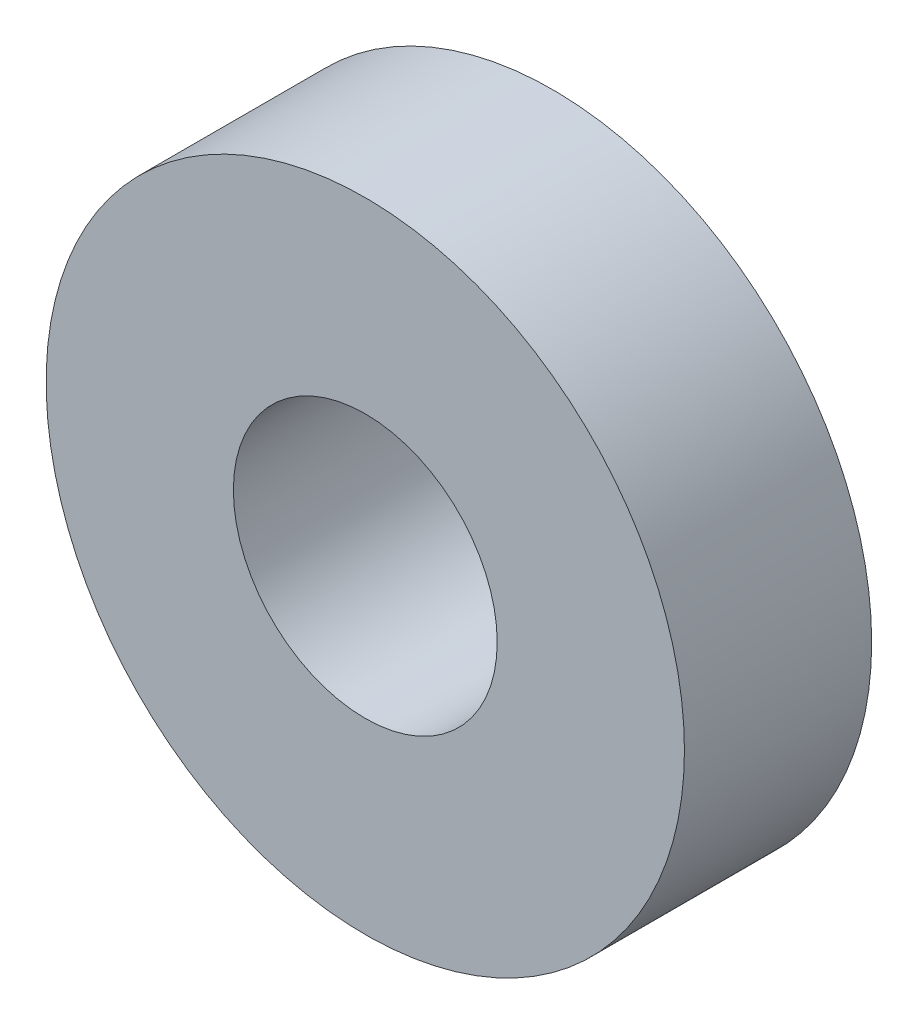
ISO-10303-21;
HEADER;
FILE_DESCRIPTION(('STEP AP214'),'2;1');
FILE_NAME('part.step','',(''),(''),'','','');
FILE_SCHEMA(('AUTOMOTIVE_DESIGN { 1 0 10303 214 1 1 1 1 }'));
ENDSEC;
DATA;
#1=APPLICATION_CONTEXT('core data for automotive mechanical design processes');
#2=APPLICATION_PROTOCOL_DEFINITION('international standard','automotive_design',2000,#1);
#3=PRODUCT_CONTEXT('',#1,'mechanical');
#4=PRODUCT('Part','Part','',(#3));
#5=PRODUCT_RELATED_PRODUCT_CATEGORY('part','',(#4));
#6=PRODUCT_DEFINITION_FORMATION('','',#4);
#7=PRODUCT_DEFINITION_CONTEXT('part definition',#1,'design');
#8=PRODUCT_DEFINITION('design','',#6,#7);
#9=PRODUCT_DEFINITION_SHAPE('','',#8);
#10=(LENGTH_UNIT() NAMED_UNIT(*) SI_UNIT(.MILLI.,.METRE.));
#11=(NAMED_UNIT(*) PLANE_ANGLE_UNIT() SI_UNIT($,.RADIAN.));
#12=(NAMED_UNIT(*) SI_UNIT($,.STERADIAN.) SOLID_ANGLE_UNIT());
#13=UNCERTAINTY_MEASURE_WITH_UNIT(LENGTH_MEASURE(1.E-05),#10,'distance_accuracy_value','');
#14=(GEOMETRIC_REPRESENTATION_CONTEXT(3) GLOBAL_UNCERTAINTY_ASSIGNED_CONTEXT((#13)) GLOBAL_UNIT_ASSIGNED_CONTEXT((#10,
#11,#12)) REPRESENTATION_CONTEXT('',''));
#15=CARTESIAN_POINT('',(0.,0.,0.));
#16=DIRECTION('',(0.,0.,1.));
#17=DIRECTION('',(1.,0.,0.));
#18=AXIS2_PLACEMENT_3D('',#15,#16,#17);
#19=CARTESIAN_POINT('',(0.,0.,-5.588));
#20=DIRECTION('',(0.,0.,1.));
#21=DIRECTION('',(1.,0.,0.));
#22=AXIS2_PLACEMENT_3D('',#19,#20,#21);
#23=CYLINDRICAL_SURFACE('',#22,9.525);
#24=CARTESIAN_POINT('',(0.,0.,0.));
#25=DIRECTION('',(0.,0.,1.));
#26=DIRECTION('',(1.,0.,0.));
#27=AXIS2_PLACEMENT_3D('',#24,#25,#26);
#28=CIRCLE('',#27,9.525);
#29=CARTESIAN_POINT('',(9.525,0.,0.));
#30=VERTEX_POINT('',#29);
#31=EDGE_CURVE('E10',#30,#30,#28,.T.);
#32=ORIENTED_EDGE('',*,*,#31,.F.);
#33=EDGE_LOOP('',(#32));
#34=FACE_BOUND('',#33,.T.);
#35=CARTESIAN_POINT('',(0.,0.,-5.588));
#36=DIRECTION('',(0.,0.,1.));
#37=DIRECTION('',(1.,0.,0.));
#38=AXIS2_PLACEMENT_3D('',#35,#36,#37);
#39=CIRCLE('',#38,9.525);
#40=CARTESIAN_POINT('',(9.525,0.,-5.588));
#41=VERTEX_POINT('',#40);
#42=EDGE_CURVE('E47',#41,#41,#39,.T.);
#43=ORIENTED_EDGE('',*,*,#42,.T.);
#44=EDGE_LOOP('',(#43));
#45=FACE_BOUND('',#44,.T.);
#46=ADVANCED_FACE('F33',(#34,#45),#23,.T.);
#47=CARTESIAN_POINT('',(0.,9.525,0.));
#48=DIRECTION('',(0.,0.,-1.));
#49=DIRECTION('',(-1.,0.,0.));
#50=AXIS2_PLACEMENT_3D('',#47,#48,#49);
#51=PLANE('',#50);
#52=CARTESIAN_POINT('',(0.,0.,0.));
#53=DIRECTION('',(0.,0.,1.));
#54=DIRECTION('',(1.,0.,0.));
#55=AXIS2_PLACEMENT_3D('',#52,#53,#54);
#56=CIRCLE('',#55,3.937);
#57=CARTESIAN_POINT('',(3.937,0.,0.));
#58=VERTEX_POINT('',#57);
#59=EDGE_CURVE('E39',#58,#58,#56,.T.);
#60=ORIENTED_EDGE('',*,*,#59,.F.);
#61=EDGE_LOOP('',(#60));
#62=FACE_BOUND('',#61,.T.);
#63=ORIENTED_EDGE('',*,*,#31,.T.);
#64=EDGE_LOOP('',(#63));
#65=FACE_BOUND('',#64,.T.);
#66=ADVANCED_FACE('F62',(#62,#65),#51,.F.);
#67=CARTESIAN_POINT('',(0.,0.,-5.588));
#68=DIRECTION('',(0.,0.,1.));
#69=DIRECTION('',(1.,0.,0.));
#70=AXIS2_PLACEMENT_3D('',#67,#68,#69);
#71=CYLINDRICAL_SURFACE('',#70,3.937);
#72=CARTESIAN_POINT('',(0.,0.,-5.588));
#73=DIRECTION('',(0.,0.,1.));
#74=DIRECTION('',(1.,0.,0.));
#75=AXIS2_PLACEMENT_3D('',#72,#73,#74);
#76=CIRCLE('',#75,3.937);
#77=CARTESIAN_POINT('',(3.937,0.,-5.588));
#78=VERTEX_POINT('',#77);
#79=EDGE_CURVE('E43',#78,#78,#76,.T.);
#80=ORIENTED_EDGE('',*,*,#79,.F.);
#81=EDGE_LOOP('',(#80));
#82=FACE_BOUND('',#81,.T.);
#83=ORIENTED_EDGE('',*,*,#59,.T.);
#84=EDGE_LOOP('',(#83));
#85=FACE_BOUND('',#84,.T.);
#86=ADVANCED_FACE('F57',(#82,#85),#71,.F.);
#87=CARTESIAN_POINT('',(0.,3.937,-5.588));
#88=DIRECTION('',(0.,0.,1.));
#89=DIRECTION('',(1.,0.,0.));
#90=AXIS2_PLACEMENT_3D('',#87,#88,#89);
#91=PLANE('',#90);
#92=ORIENTED_EDGE('',*,*,#42,.F.);
#93=EDGE_LOOP('',(#92));
#94=FACE_BOUND('',#93,.T.);
#95=ORIENTED_EDGE('',*,*,#79,.T.);
#96=EDGE_LOOP('',(#95));
#97=FACE_BOUND('',#96,.T.);
#98=ADVANCED_FACE('F54',(#94,#97),#91,.F.);
#99=CLOSED_SHELL('',(#46,#66,#86,#98));
#100=MANIFOLD_SOLID_BREP('B2',#99);
#101=ADVANCED_BREP_SHAPE_REPRESENTATION('',(#18,#100),#14);
#102=SHAPE_DEFINITION_REPRESENTATION(#9,#101);
ENDSEC;
END-ISO-10303-21;
